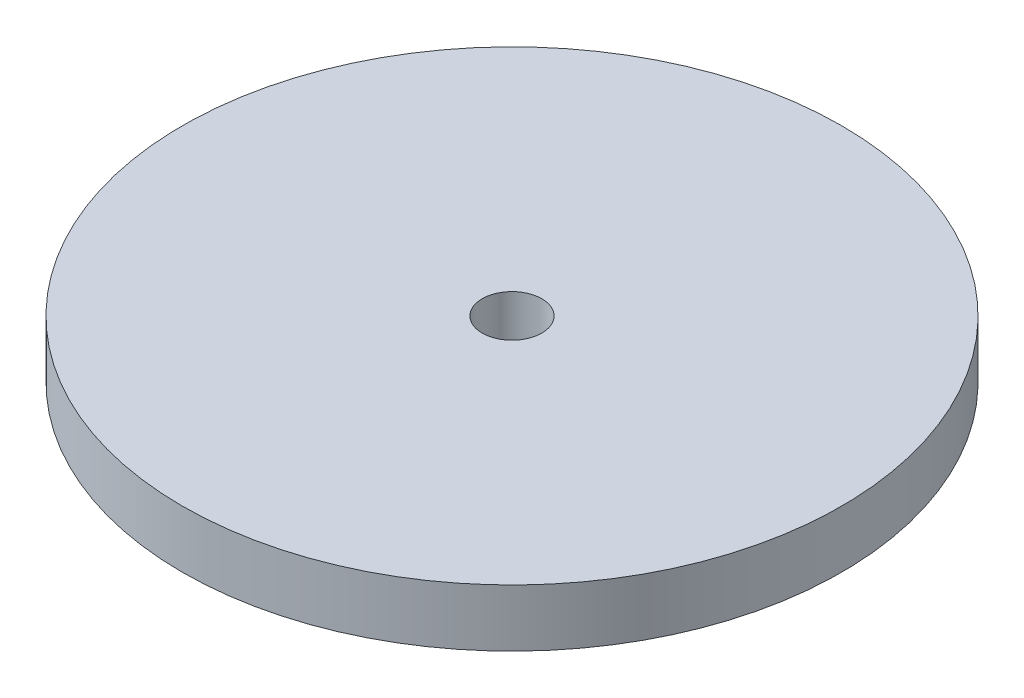
ISO-10303-21;
HEADER;
FILE_DESCRIPTION(('STEP AP214'),'2;1');
FILE_NAME('part.step','',(''),(''),'','','');
FILE_SCHEMA(('AUTOMOTIVE_DESIGN { 1 0 10303 214 1 1 1 1 }'));
ENDSEC;
DATA;
#1=APPLICATION_CONTEXT('core data for automotive mechanical design processes');
#2=APPLICATION_PROTOCOL_DEFINITION('international standard','automotive_design',2000,#1);
#3=PRODUCT_CONTEXT('',#1,'mechanical');
#4=PRODUCT('Part','Part','',(#3));
#5=PRODUCT_RELATED_PRODUCT_CATEGORY('part','',(#4));
#6=PRODUCT_DEFINITION_FORMATION('','',#4);
#7=PRODUCT_DEFINITION_CONTEXT('part definition',#1,'design');
#8=PRODUCT_DEFINITION('design','',#6,#7);
#9=PRODUCT_DEFINITION_SHAPE('','',#8);
#10=(LENGTH_UNIT() NAMED_UNIT(*) SI_UNIT(.MILLI.,.METRE.));
#11=(NAMED_UNIT(*) PLANE_ANGLE_UNIT() SI_UNIT($,.RADIAN.));
#12=(NAMED_UNIT(*) SI_UNIT($,.STERADIAN.) SOLID_ANGLE_UNIT());
#13=UNCERTAINTY_MEASURE_WITH_UNIT(LENGTH_MEASURE(1.E-05),#10,'distance_accuracy_value','');
#14=(GEOMETRIC_REPRESENTATION_CONTEXT(3) GLOBAL_UNCERTAINTY_ASSIGNED_CONTEXT((#13)) GLOBAL_UNIT_ASSIGNED_CONTEXT((#10,
#11,#12)) REPRESENTATION_CONTEXT('',''));
#15=CARTESIAN_POINT('',(0.,0.,0.));
#16=DIRECTION('',(0.,0.,1.));
#17=DIRECTION('',(1.,0.,0.));
#18=AXIS2_PLACEMENT_3D('',#15,#16,#17);
#19=CARTESIAN_POINT('',(0.,6.35,0.));
#20=DIRECTION('',(0.,1.,0.));
#21=DIRECTION('',(0.,0.,1.));
#22=AXIS2_PLACEMENT_3D('',#19,#20,#21);
#23=PLANE('',#22);
#24=CARTESIAN_POINT('',(0.,6.35,0.));
#25=DIRECTION('',(0.,1.,0.));
#26=DIRECTION('',(0.,0.,1.));
#27=AXIS2_PLACEMENT_3D('',#24,#25,#26);
#28=CIRCLE('',#27,36.5125);
#29=CARTESIAN_POINT('',(0.,6.35,36.5125));
#30=VERTEX_POINT('',#29);
#31=EDGE_CURVE('E10',#30,#30,#28,.T.);
#32=ORIENTED_EDGE('',*,*,#31,.T.);
#33=EDGE_LOOP('',(#32));
#34=FACE_BOUND('',#33,.T.);
#35=CARTESIAN_POINT('',(0.,6.35,0.));
#36=DIRECTION('',(0.,1.,0.));
#37=DIRECTION('',(0.,0.,1.));
#38=AXIS2_PLACEMENT_3D('',#35,#36,#37);
#39=CIRCLE('',#38,3.302);
#40=CARTESIAN_POINT('',(0.,6.35,3.302));
#41=VERTEX_POINT('',#40);
#42=EDGE_CURVE('E41',#41,#41,#39,.T.);
#43=ORIENTED_EDGE('',*,*,#42,.F.);
#44=EDGE_LOOP('',(#43));
#45=FACE_BOUND('',#44,.T.);
#46=ADVANCED_FACE('F30',(#34,#45),#23,.T.);
#47=CARTESIAN_POINT('',(0.,0.,0.));
#48=DIRECTION('',(0.,1.,0.));
#49=DIRECTION('',(0.,0.,1.));
#50=AXIS2_PLACEMENT_3D('',#47,#48,#49);
#51=PLANE('',#50);
#52=CARTESIAN_POINT('',(0.,0.,0.));
#53=DIRECTION('',(0.,1.,0.));
#54=DIRECTION('',(0.,0.,1.));
#55=AXIS2_PLACEMENT_3D('',#52,#53,#54);
#56=CIRCLE('',#55,36.5125);
#57=CARTESIAN_POINT('',(0.,0.,36.5125));
#58=VERTEX_POINT('',#57);
#59=EDGE_CURVE('E34',#58,#58,#56,.T.);
#60=ORIENTED_EDGE('',*,*,#59,.F.);
#61=EDGE_LOOP('',(#60));
#62=FACE_BOUND('',#61,.T.);
#63=CARTESIAN_POINT('',(0.,0.,0.));
#64=DIRECTION('',(0.,1.,0.));
#65=DIRECTION('',(0.,0.,1.));
#66=AXIS2_PLACEMENT_3D('',#63,#64,#65);
#67=CIRCLE('',#66,3.302);
#68=CARTESIAN_POINT('',(0.,0.,3.302));
#69=VERTEX_POINT('',#68);
#70=EDGE_CURVE('E43',#69,#69,#67,.T.);
#71=ORIENTED_EDGE('',*,*,#70,.T.);
#72=EDGE_LOOP('',(#71));
#73=FACE_BOUND('',#72,.T.);
#74=ADVANCED_FACE('F53',(#62,#73),#51,.F.);
#75=CARTESIAN_POINT('',(0.,6.35,0.));
#76=DIRECTION('',(0.,-1.,0.));
#77=DIRECTION('',(0.,0.,-1.));
#78=AXIS2_PLACEMENT_3D('',#75,#76,#77);
#79=CYLINDRICAL_SURFACE('',#78,36.5125);
#80=ORIENTED_EDGE('',*,*,#31,.F.);
#81=EDGE_LOOP('',(#80));
#82=FACE_BOUND('',#81,.T.);
#83=ORIENTED_EDGE('',*,*,#59,.T.);
#84=EDGE_LOOP('',(#83));
#85=FACE_BOUND('',#84,.T.);
#86=ADVANCED_FACE('F32',(#82,#85),#79,.T.);
#87=CARTESIAN_POINT('',(0.,6.35,0.));
#88=DIRECTION('',(0.,-1.,0.));
#89=DIRECTION('',(0.,0.,-1.));
#90=AXIS2_PLACEMENT_3D('',#87,#88,#89);
#91=CYLINDRICAL_SURFACE('',#90,3.302);
#92=ORIENTED_EDGE('',*,*,#42,.T.);
#93=EDGE_LOOP('',(#92));
#94=FACE_BOUND('',#93,.T.);
#95=ORIENTED_EDGE('',*,*,#70,.F.);
#96=EDGE_LOOP('',(#95));
#97=FACE_BOUND('',#96,.T.);
#98=ADVANCED_FACE('F49',(#94,#97),#91,.F.);
#99=CLOSED_SHELL('',(#46,#74,#86,#98));
#100=MANIFOLD_SOLID_BREP('B2',#99);
#101=ADVANCED_BREP_SHAPE_REPRESENTATION('',(#18,#100),#14);
#102=SHAPE_DEFINITION_REPRESENTATION(#9,#101);
ENDSEC;
END-ISO-10303-21;
